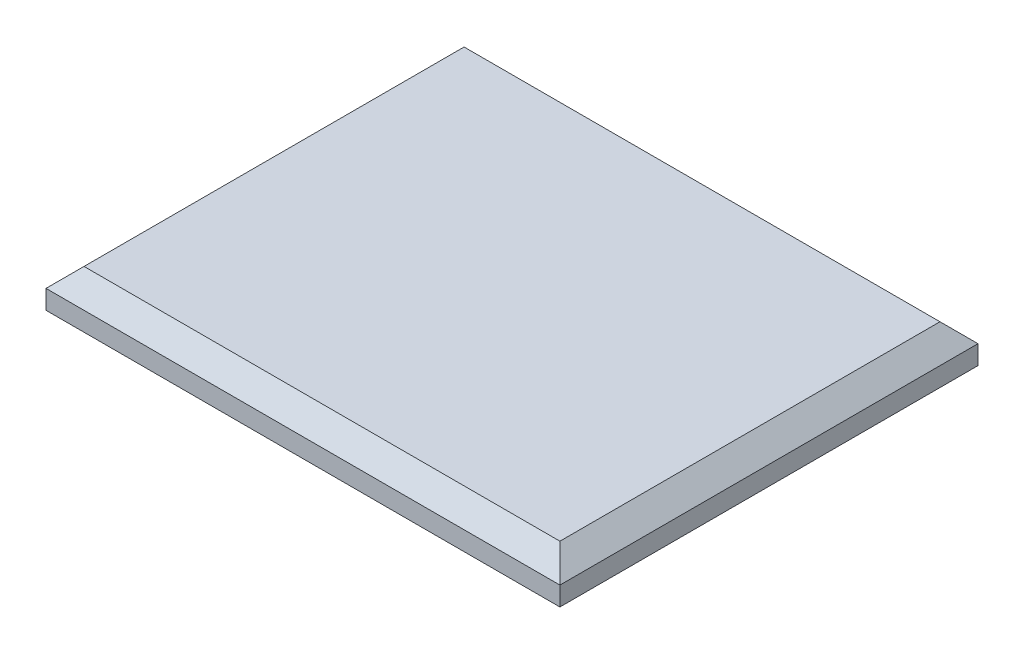
ISO-10303-21;
HEADER;
FILE_DESCRIPTION(('STEP AP214'),'2;1');
FILE_NAME('part.step','',(''),(''),'','','');
FILE_SCHEMA(('AUTOMOTIVE_DESIGN { 1 0 10303 214 1 1 1 1 }'));
ENDSEC;
DATA;
#1=APPLICATION_CONTEXT('core data for automotive mechanical design processes');
#2=APPLICATION_PROTOCOL_DEFINITION('international standard','automotive_design',2000,#1);
#3=PRODUCT_CONTEXT('',#1,'mechanical');
#4=PRODUCT('Part','Part','',(#3));
#5=PRODUCT_RELATED_PRODUCT_CATEGORY('part','',(#4));
#6=PRODUCT_DEFINITION_FORMATION('','',#4);
#7=PRODUCT_DEFINITION_CONTEXT('part definition',#1,'design');
#8=PRODUCT_DEFINITION('design','',#6,#7);
#9=PRODUCT_DEFINITION_SHAPE('','',#8);
#10=(LENGTH_UNIT() NAMED_UNIT(*) SI_UNIT(.MILLI.,.METRE.));
#11=(NAMED_UNIT(*) PLANE_ANGLE_UNIT() SI_UNIT($,.RADIAN.));
#12=(NAMED_UNIT(*) SI_UNIT($,.STERADIAN.) SOLID_ANGLE_UNIT());
#13=UNCERTAINTY_MEASURE_WITH_UNIT(LENGTH_MEASURE(1.E-05),#10,'distance_accuracy_value','');
#14=(GEOMETRIC_REPRESENTATION_CONTEXT(3) GLOBAL_UNCERTAINTY_ASSIGNED_CONTEXT((#13)) GLOBAL_UNIT_ASSIGNED_CONTEXT((#10,
#11,#12)) REPRESENTATION_CONTEXT('',''));
#15=CARTESIAN_POINT('',(0.,0.,0.));
#16=DIRECTION('',(0.,0.,1.));
#17=DIRECTION('',(1.,0.,0.));
#18=AXIS2_PLACEMENT_3D('',#15,#16,#17);
#19=CARTESIAN_POINT('',(67.605,10.,-55.));
#20=DIRECTION('',(-1.,0.,0.));
#21=DIRECTION('',(0.,0.,1.));
#22=AXIS2_PLACEMENT_3D('',#19,#20,#21);
#23=PLANE('',#22);
#24=DIRECTION('',(0.,-1.,0.));
#25=VECTOR('',#24,1.);
#26=CARTESIAN_POINT('',(67.605,10.,-55.));
#27=LINE('',#26,#25);
#28=CARTESIAN_POINT('',(67.605,4.99999999999997,-55.));
#29=VERTEX_POINT('',#28);
#30=CARTESIAN_POINT('',(67.605,0.,-55.));
#31=VERTEX_POINT('',#30);
#32=EDGE_CURVE('E86',#29,#31,#27,.T.);
#33=ORIENTED_EDGE('',*,*,#32,.F.);
#34=DIRECTION('',(0.,0.,1.));
#35=VECTOR('',#34,1.);
#36=CARTESIAN_POINT('',(67.605,4.99999999999997,55.));
#37=LINE('',#36,#35);
#38=CARTESIAN_POINT('',(67.605,4.99999999999997,55.));
#39=VERTEX_POINT('',#38);
#40=EDGE_CURVE('E56',#29,#39,#37,.T.);
#41=ORIENTED_EDGE('',*,*,#40,.T.);
#42=DIRECTION('',(0.,-1.,0.));
#43=VECTOR('',#42,1.);
#44=CARTESIAN_POINT('',(67.605,10.,55.));
#45=LINE('',#44,#43);
#46=CARTESIAN_POINT('',(67.605,0.,55.));
#47=VERTEX_POINT('',#46);
#48=EDGE_CURVE('E106',#39,#47,#45,.T.);
#49=ORIENTED_EDGE('',*,*,#48,.T.);
#50=DIRECTION('',(0.,0.,-1.));
#51=VECTOR('',#50,1.);
#52=CARTESIAN_POINT('',(67.605,0.,-55.));
#53=LINE('',#52,#51);
#54=EDGE_CURVE('E102',#47,#31,#53,.T.);
#55=ORIENTED_EDGE('',*,*,#54,.T.);
#56=EDGE_LOOP('',(#33,#41,#49,#55));
#57=FACE_BOUND('',#56,.T.);
#58=ADVANCED_FACE('F32',(#57),#23,.F.);
#59=CARTESIAN_POINT('',(-67.605,10.,-55.));
#60=DIRECTION('',(0.,0.,1.));
#61=DIRECTION('',(1.,0.,0.));
#62=AXIS2_PLACEMENT_3D('',#59,#60,#61);
#63=PLANE('',#62);
#64=DIRECTION('',(0.,-1.,0.));
#65=VECTOR('',#64,1.);
#66=CARTESIAN_POINT('',(-67.605,10.,-55.));
#67=LINE('',#66,#65);
#68=CARTESIAN_POINT('',(-67.605,4.99999999999997,-55.));
#69=VERTEX_POINT('',#68);
#70=CARTESIAN_POINT('',(-67.605,0.,-55.));
#71=VERTEX_POINT('',#70);
#72=EDGE_CURVE('E96',#69,#71,#67,.T.);
#73=ORIENTED_EDGE('',*,*,#72,.F.);
#74=DIRECTION('',(1.,0.,0.));
#75=VECTOR('',#74,1.);
#76=CARTESIAN_POINT('',(67.605,4.99999999999997,-55.));
#77=LINE('',#76,#75);
#78=EDGE_CURVE('E93',#69,#29,#77,.T.);
#79=ORIENTED_EDGE('',*,*,#78,.T.);
#80=ORIENTED_EDGE('',*,*,#32,.T.);
#81=DIRECTION('',(-1.,0.,0.));
#82=VECTOR('',#81,1.);
#83=CARTESIAN_POINT('',(-67.605,0.,-55.));
#84=LINE('',#83,#82);
#85=EDGE_CURVE('E90',#31,#71,#84,.T.);
#86=ORIENTED_EDGE('',*,*,#85,.T.);
#87=EDGE_LOOP('',(#73,#79,#80,#86));
#88=FACE_BOUND('',#87,.T.);
#89=ADVANCED_FACE('F89',(#88),#63,.F.);
#90=CARTESIAN_POINT('',(-67.605,10.,-55.));
#91=DIRECTION('',(1.,0.,0.));
#92=DIRECTION('',(0.,0.,-1.));
#93=AXIS2_PLACEMENT_3D('',#90,#91,#92);
#94=PLANE('',#93);
#95=DIRECTION('',(0.,-1.,0.));
#96=VECTOR('',#95,1.);
#97=CARTESIAN_POINT('',(-67.605,10.,55.));
#98=LINE('',#97,#96);
#99=CARTESIAN_POINT('',(-67.605,4.99999999999997,55.));
#100=VERTEX_POINT('',#99);
#101=CARTESIAN_POINT('',(-67.605,0.,55.));
#102=VERTEX_POINT('',#101);
#103=EDGE_CURVE('E116',#100,#102,#98,.T.);
#104=ORIENTED_EDGE('',*,*,#103,.F.);
#105=DIRECTION('',(0.,0.,-1.));
#106=VECTOR('',#105,1.);
#107=CARTESIAN_POINT('',(-67.605,4.99999999999997,-55.));
#108=LINE('',#107,#106);
#109=EDGE_CURVE('E11',#100,#69,#108,.T.);
#110=ORIENTED_EDGE('',*,*,#109,.T.);
#111=ORIENTED_EDGE('',*,*,#72,.T.);
#112=DIRECTION('',(0.,0.,1.));
#113=VECTOR('',#112,1.);
#114=CARTESIAN_POINT('',(-67.605,0.,-55.));
#115=LINE('',#114,#113);
#116=EDGE_CURVE('E104',#71,#102,#115,.T.);
#117=ORIENTED_EDGE('',*,*,#116,.T.);
#118=EDGE_LOOP('',(#104,#110,#111,#117));
#119=FACE_BOUND('',#118,.T.);
#120=ADVANCED_FACE('F163',(#119),#94,.F.);
#121=CARTESIAN_POINT('',(-67.605,10.,55.));
#122=DIRECTION('',(0.,0.,-1.));
#123=DIRECTION('',(-1.,0.,0.));
#124=AXIS2_PLACEMENT_3D('',#121,#122,#123);
#125=PLANE('',#124);
#126=ORIENTED_EDGE('',*,*,#48,.F.);
#127=DIRECTION('',(-1.,0.,0.));
#128=VECTOR('',#127,1.);
#129=CARTESIAN_POINT('',(-67.605,4.99999999999997,55.));
#130=LINE('',#129,#128);
#131=EDGE_CURVE('E41',#39,#100,#130,.T.);
#132=ORIENTED_EDGE('',*,*,#131,.T.);
#133=ORIENTED_EDGE('',*,*,#103,.T.);
#134=DIRECTION('',(1.,0.,0.));
#135=VECTOR('',#134,1.);
#136=CARTESIAN_POINT('',(-67.605,0.,55.));
#137=LINE('',#136,#135);
#138=EDGE_CURVE('E113',#102,#47,#137,.T.);
#139=ORIENTED_EDGE('',*,*,#138,.T.);
#140=EDGE_LOOP('',(#126,#132,#133,#139));
#141=FACE_BOUND('',#140,.T.);
#142=ADVANCED_FACE('F195',(#141),#125,.F.);
#143=CARTESIAN_POINT('',(0.,10.,0.));
#144=DIRECTION('',(0.,1.,0.));
#145=DIRECTION('',(0.,0.,1.));
#146=AXIS2_PLACEMENT_3D('',#143,#144,#145);
#147=PLANE('',#146);
#148=DIRECTION('',(0.,0.,-1.));
#149=VECTOR('',#148,1.);
#150=CARTESIAN_POINT('',(62.605,10.,-55.));
#151=LINE('',#150,#149);
#152=CARTESIAN_POINT('',(62.605,10.,50.));
#153=VERTEX_POINT('',#152);
#154=CARTESIAN_POINT('',(62.605,10.,-50.));
#155=VERTEX_POINT('',#154);
#156=EDGE_CURVE('E122',#153,#155,#151,.T.);
#157=ORIENTED_EDGE('',*,*,#156,.T.);
#158=DIRECTION('',(-1.,0.,0.));
#159=VECTOR('',#158,1.);
#160=CARTESIAN_POINT('',(-67.605,10.,-50.));
#161=LINE('',#160,#159);
#162=CARTESIAN_POINT('',(-62.605,10.,-50.));
#163=VERTEX_POINT('',#162);
#164=EDGE_CURVE('E124',#155,#163,#161,.T.);
#165=ORIENTED_EDGE('',*,*,#164,.T.);
#166=DIRECTION('',(0.,0.,1.));
#167=VECTOR('',#166,1.);
#168=CARTESIAN_POINT('',(-62.605,10.,55.));
#169=LINE('',#168,#167);
#170=CARTESIAN_POINT('',(-62.605,10.,50.));
#171=VERTEX_POINT('',#170);
#172=EDGE_CURVE('E95',#163,#171,#169,.T.);
#173=ORIENTED_EDGE('',*,*,#172,.T.);
#174=DIRECTION('',(1.,0.,0.));
#175=VECTOR('',#174,1.);
#176=CARTESIAN_POINT('',(67.605,10.,50.));
#177=LINE('',#176,#175);
#178=EDGE_CURVE('E120',#171,#153,#177,.T.);
#179=ORIENTED_EDGE('',*,*,#178,.T.);
#180=EDGE_LOOP('',(#157,#165,#173,#179));
#181=FACE_BOUND('',#180,.T.);
#182=ADVANCED_FACE('F145',(#181),#147,.T.);
#183=CARTESIAN_POINT('',(0.,0.,0.));
#184=DIRECTION('',(0.,1.,0.));
#185=DIRECTION('',(0.,0.,1.));
#186=AXIS2_PLACEMENT_3D('',#183,#184,#185);
#187=PLANE('',#186);
#188=ORIENTED_EDGE('',*,*,#54,.F.);
#189=ORIENTED_EDGE('',*,*,#138,.F.);
#190=ORIENTED_EDGE('',*,*,#116,.F.);
#191=ORIENTED_EDGE('',*,*,#85,.F.);
#192=EDGE_LOOP('',(#188,#189,#190,#191));
#193=FACE_BOUND('',#192,.T.);
#194=ADVANCED_FACE('F100',(#193),#187,.F.);
#195=CARTESIAN_POINT('',(0.,10.,50.));
#196=DIRECTION('',(0.,0.707106781186546,0.707106781186548));
#197=DIRECTION('',(-1.,0.,0.));
#198=AXIS2_PLACEMENT_3D('',#195,#196,#197);
#199=PLANE('',#198);
#200=DIRECTION('',(0.577350269189625,0.577350269189627,-0.577350269189625));
#201=VECTOR('',#200,1.);
#202=CARTESIAN_POINT('',(-45.9383333333333,26.6666666666667,33.3333333333333));
#203=LINE('',#202,#201);
#204=EDGE_CURVE('E110',#100,#171,#203,.T.);
#205=ORIENTED_EDGE('',*,*,#204,.F.);
#206=ORIENTED_EDGE('',*,*,#131,.F.);
#207=DIRECTION('',(-0.577350269189625,0.577350269189627,-0.577350269189625));
#208=VECTOR('',#207,1.);
#209=CARTESIAN_POINT('',(41.7366666666667,30.8683333333334,29.1316666666667));
#210=LINE('',#209,#208);
#211=EDGE_CURVE('E36',#153,#39,#210,.F.);
#212=ORIENTED_EDGE('',*,*,#211,.F.);
#213=ORIENTED_EDGE('',*,*,#178,.F.);
#214=EDGE_LOOP('',(#205,#206,#212,#213));
#215=FACE_BOUND('',#214,.T.);
#216=ADVANCED_FACE('F34',(#215),#199,.T.);
#217=CARTESIAN_POINT('',(62.605,10.,0.));
#218=DIRECTION('',(0.707106781186548,0.707106781186546,0.));
#219=DIRECTION('',(0.,0.,1.));
#220=AXIS2_PLACEMENT_3D('',#217,#218,#219);
#221=PLANE('',#220);
#222=ORIENTED_EDGE('',*,*,#211,.T.);
#223=ORIENTED_EDGE('',*,*,#40,.F.);
#224=DIRECTION('',(-0.577350269189625,0.577350269189627,0.577350269189625));
#225=VECTOR('',#224,1.);
#226=CARTESIAN_POINT('',(45.9383333333334,26.6666666666667,-33.3333333333333));
#227=LINE('',#226,#225);
#228=EDGE_CURVE('E132',#155,#29,#227,.F.);
#229=ORIENTED_EDGE('',*,*,#228,.F.);
#230=ORIENTED_EDGE('',*,*,#156,.F.);
#231=EDGE_LOOP('',(#222,#223,#229,#230));
#232=FACE_BOUND('',#231,.T.);
#233=ADVANCED_FACE('F151',(#232),#221,.T.);
#234=CARTESIAN_POINT('',(-62.605,10.,0.));
#235=DIRECTION('',(-0.707106781186548,0.707106781186546,0.));
#236=DIRECTION('',(0.,0.,-1.));
#237=AXIS2_PLACEMENT_3D('',#234,#235,#236);
#238=PLANE('',#237);
#239=ORIENTED_EDGE('',*,*,#204,.T.);
#240=ORIENTED_EDGE('',*,*,#172,.F.);
#241=DIRECTION('',(-0.577350269189625,-0.577350269189627,-0.577350269189625));
#242=VECTOR('',#241,1.);
#243=CARTESIAN_POINT('',(-45.9383333333333,26.6666666666667,-33.3333333333333));
#244=LINE('',#243,#242);
#245=EDGE_CURVE('E130',#69,#163,#244,.F.);
#246=ORIENTED_EDGE('',*,*,#245,.F.);
#247=ORIENTED_EDGE('',*,*,#109,.F.);
#248=EDGE_LOOP('',(#239,#240,#246,#247));
#249=FACE_BOUND('',#248,.T.);
#250=ADVANCED_FACE('F138',(#249),#238,.T.);
#251=CARTESIAN_POINT('',(0.,10.,-50.));
#252=DIRECTION('',(0.,0.707106781186546,-0.707106781186548));
#253=DIRECTION('',(1.,0.,0.));
#254=AXIS2_PLACEMENT_3D('',#251,#252,#253);
#255=PLANE('',#254);
#256=ORIENTED_EDGE('',*,*,#228,.T.);
#257=ORIENTED_EDGE('',*,*,#78,.F.);
#258=ORIENTED_EDGE('',*,*,#245,.T.);
#259=ORIENTED_EDGE('',*,*,#164,.F.);
#260=EDGE_LOOP('',(#256,#257,#258,#259));
#261=FACE_BOUND('',#260,.T.);
#262=ADVANCED_FACE('F149',(#261),#255,.T.);
#263=CLOSED_SHELL('',(#58,#89,#120,#142,#182,#194,#216,#233,#250,#262));
#264=MANIFOLD_SOLID_BREP('B2',#263);
#265=ADVANCED_BREP_SHAPE_REPRESENTATION('',(#18,#264),#14);
#266=SHAPE_DEFINITION_REPRESENTATION(#9,#265);
ENDSEC;
END-ISO-10303-21;
